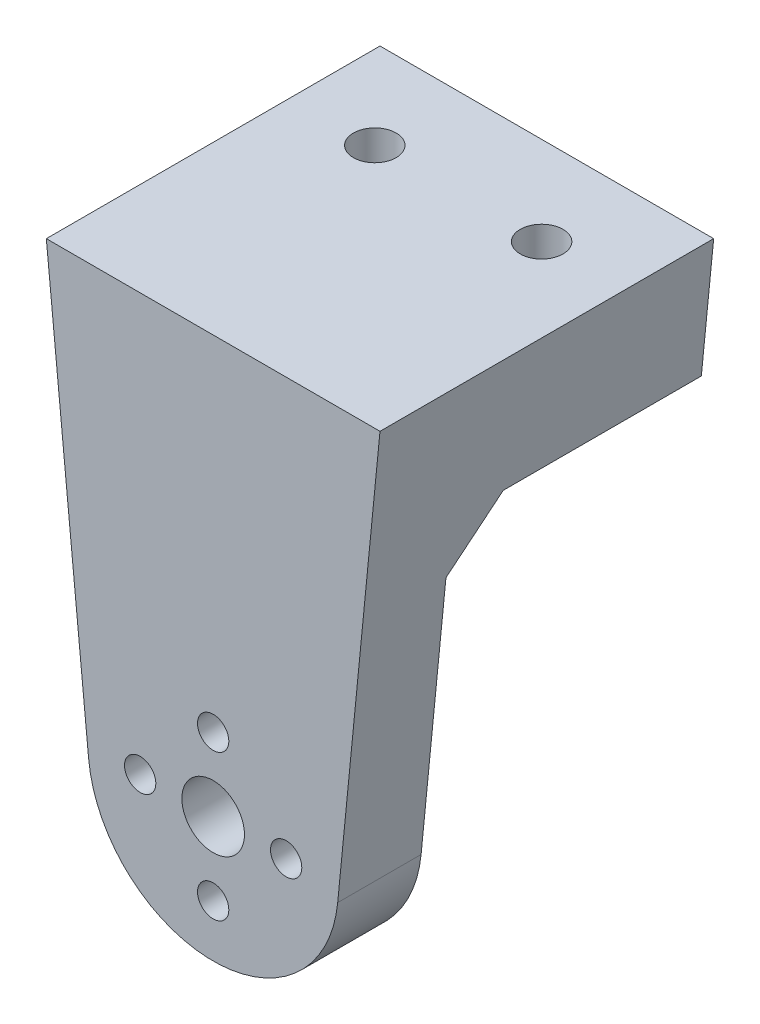
ISO-10303-21;
HEADER;
FILE_DESCRIPTION(('STEP AP214'),'2;1');
FILE_NAME('part.step','',(''),(''),'','','');
FILE_SCHEMA(('AUTOMOTIVE_DESIGN { 1 0 10303 214 1 1 1 1 }'));
ENDSEC;
DATA;
#1=APPLICATION_CONTEXT('core data for automotive mechanical design processes');
#2=APPLICATION_PROTOCOL_DEFINITION('international standard','automotive_design',2000,#1);
#3=PRODUCT_CONTEXT('',#1,'mechanical');
#4=PRODUCT('Part','Part','',(#3));
#5=PRODUCT_RELATED_PRODUCT_CATEGORY('part','',(#4));
#6=PRODUCT_DEFINITION_FORMATION('','',#4);
#7=PRODUCT_DEFINITION_CONTEXT('part definition',#1,'design');
#8=PRODUCT_DEFINITION('design','',#6,#7);
#9=PRODUCT_DEFINITION_SHAPE('','',#8);
#10=(LENGTH_UNIT() NAMED_UNIT(*) SI_UNIT(.MILLI.,.METRE.));
#11=(NAMED_UNIT(*) PLANE_ANGLE_UNIT() SI_UNIT($,.RADIAN.));
#12=(NAMED_UNIT(*) SI_UNIT($,.STERADIAN.) SOLID_ANGLE_UNIT());
#13=UNCERTAINTY_MEASURE_WITH_UNIT(LENGTH_MEASURE(1.E-05),#10,'distance_accuracy_value','');
#14=(GEOMETRIC_REPRESENTATION_CONTEXT(3) GLOBAL_UNCERTAINTY_ASSIGNED_CONTEXT((#13)) GLOBAL_UNIT_ASSIGNED_CONTEXT((#10,
#11,#12)) REPRESENTATION_CONTEXT('',''));
#15=CARTESIAN_POINT('',(0.,0.,0.));
#16=DIRECTION('',(0.,0.,1.));
#17=DIRECTION('',(1.,0.,0.));
#18=AXIS2_PLACEMENT_3D('',#15,#16,#17);
#19=CARTESIAN_POINT('',(0.,0.,0.));
#20=DIRECTION('',(0.,0.,1.));
#21=DIRECTION('',(1.,0.,0.));
#22=AXIS2_PLACEMENT_3D('',#19,#20,#21);
#23=PLANE('',#22);
#24=CARTESIAN_POINT('',(0.,0.,0.));
#25=DIRECTION('',(0.,0.,-1.));
#26=DIRECTION('',(-1.,0.,0.));
#27=AXIS2_PLACEMENT_3D('',#24,#25,#26);
#28=CIRCLE('',#27,3.);
#29=CARTESIAN_POINT('',(-3.,0.,0.));
#30=VERTEX_POINT('',#29);
#31=EDGE_CURVE('E115',#30,#30,#28,.T.);
#32=ORIENTED_EDGE('',*,*,#31,.F.);
#33=EDGE_LOOP('',(#32));
#34=FACE_BOUND('',#33,.T.);
#35=CARTESIAN_POINT('',(7.,0.,0.));
#36=DIRECTION('',(0.,0.,1.));
#37=DIRECTION('',(1.,0.,0.));
#38=AXIS2_PLACEMENT_3D('',#35,#36,#37);
#39=CIRCLE('',#38,1.5);
#40=CARTESIAN_POINT('',(8.5,0.,0.));
#41=VERTEX_POINT('',#40);
#42=EDGE_CURVE('E157',#41,#41,#39,.T.);
#43=ORIENTED_EDGE('',*,*,#42,.T.);
#44=EDGE_LOOP('',(#43));
#45=FACE_BOUND('',#44,.T.);
#46=CARTESIAN_POINT('',(0.,-7.,0.));
#47=DIRECTION('',(0.,0.,1.));
#48=DIRECTION('',(1.,0.,0.));
#49=AXIS2_PLACEMENT_3D('',#46,#47,#48);
#50=CIRCLE('',#49,1.5);
#51=CARTESIAN_POINT('',(1.5,-7.,0.));
#52=VERTEX_POINT('',#51);
#53=EDGE_CURVE('E154',#52,#52,#50,.T.);
#54=ORIENTED_EDGE('',*,*,#53,.T.);
#55=EDGE_LOOP('',(#54));
#56=FACE_BOUND('',#55,.T.);
#57=CARTESIAN_POINT('',(-7.,0.,0.));
#58=DIRECTION('',(0.,0.,1.));
#59=DIRECTION('',(1.,0.,0.));
#60=AXIS2_PLACEMENT_3D('',#57,#58,#59);
#61=CIRCLE('',#60,1.5);
#62=CARTESIAN_POINT('',(-5.5,0.,0.));
#63=VERTEX_POINT('',#62);
#64=EDGE_CURVE('E122',#63,#63,#61,.T.);
#65=ORIENTED_EDGE('',*,*,#64,.T.);
#66=EDGE_LOOP('',(#65));
#67=FACE_BOUND('',#66,.T.);
#68=CARTESIAN_POINT('',(0.,7.,0.));
#69=DIRECTION('',(0.,0.,1.));
#70=DIRECTION('',(1.,0.,0.));
#71=AXIS2_PLACEMENT_3D('',#68,#69,#70);
#72=CIRCLE('',#71,1.5);
#73=CARTESIAN_POINT('',(1.5,7.,0.));
#74=VERTEX_POINT('',#73);
#75=EDGE_CURVE('E119',#74,#74,#72,.T.);
#76=ORIENTED_EDGE('',*,*,#75,.T.);
#77=EDGE_LOOP('',(#76));
#78=FACE_BOUND('',#77,.T.);
#79=DIRECTION('',(-0.0980717390616762,0.99517934765419,0.));
#80=VECTOR('',#79,1.);
#81=CARTESIAN_POINT('',(-11.9421521718503,-1.17686086874011,0.));
#82=LINE('',#81,#80);
#83=CARTESIAN_POINT('',(-11.9421521718503,-1.17686086874012,0.));
#84=VERTEX_POINT('',#83);
#85=CARTESIAN_POINT('',(-14.324704418376,23.,0.));
#86=VERTEX_POINT('',#85);
#87=EDGE_CURVE('E131',#84,#86,#82,.T.);
#88=ORIENTED_EDGE('',*,*,#87,.T.);
#89=DIRECTION('',(1.,0.,0.));
#90=VECTOR('',#89,1.);
#91=CARTESIAN_POINT('',(14.8174384129713,23.,0.));
#92=LINE('',#91,#90);
#93=CARTESIAN_POINT('',(14.324704418376,23.,0.));
#94=VERTEX_POINT('',#93);
#95=EDGE_CURVE('E58',#86,#94,#92,.T.);
#96=ORIENTED_EDGE('',*,*,#95,.T.);
#97=DIRECTION('',(-0.0980717390616759,-0.99517934765419,0.));
#98=VECTOR('',#97,1.);
#99=CARTESIAN_POINT('',(11.9421521718503,-1.17686086874011,0.));
#100=LINE('',#99,#98);
#101=CARTESIAN_POINT('',(11.9421521718503,-1.17686086874011,0.));
#102=VERTEX_POINT('',#101);
#103=EDGE_CURVE('E163',#94,#102,#100,.T.);
#104=ORIENTED_EDGE('',*,*,#103,.T.);
#105=CARTESIAN_POINT('',(0.,0.,0.));
#106=DIRECTION('',(0.,0.,1.));
#107=DIRECTION('',(1.,0.,0.));
#108=AXIS2_PLACEMENT_3D('',#105,#106,#107);
#109=CIRCLE('',#108,12.);
#110=EDGE_CURVE('E160',#84,#102,#109,.T.);
#111=ORIENTED_EDGE('',*,*,#110,.F.);
#112=EDGE_LOOP('',(#88,#96,#104,#111));
#113=FACE_BOUND('',#112,.T.);
#114=ADVANCED_FACE('F36',(#34,#45,#56,#67,#78,#113),#23,.F.);
#115=CARTESIAN_POINT('',(0.,0.,8.));
#116=DIRECTION('',(0.,0.,-1.));
#117=DIRECTION('',(-1.,0.,0.));
#118=AXIS2_PLACEMENT_3D('',#115,#116,#117);
#119=CYLINDRICAL_SURFACE('',#118,12.);
#120=ORIENTED_EDGE('',*,*,#110,.T.);
#121=DIRECTION('',(0.,0.,-1.));
#122=VECTOR('',#121,1.);
#123=CARTESIAN_POINT('',(11.9421521718503,-1.17686086874011,8.));
#124=LINE('',#123,#122);
#125=CARTESIAN_POINT('',(11.9421521718503,-1.17686086874011,8.));
#126=VERTEX_POINT('',#125);
#127=EDGE_CURVE('E171',#126,#102,#124,.T.);
#128=ORIENTED_EDGE('',*,*,#127,.F.);
#129=CARTESIAN_POINT('',(0.,0.,8.));
#130=DIRECTION('',(0.,0.,1.));
#131=DIRECTION('',(1.,0.,0.));
#132=AXIS2_PLACEMENT_3D('',#129,#130,#131);
#133=CIRCLE('',#132,12.);
#134=CARTESIAN_POINT('',(-11.9421521718503,-1.17686086874012,8.));
#135=VERTEX_POINT('',#134);
#136=EDGE_CURVE('E140',#135,#126,#133,.T.);
#137=ORIENTED_EDGE('',*,*,#136,.F.);
#138=DIRECTION('',(0.,0.,-1.));
#139=VECTOR('',#138,1.);
#140=CARTESIAN_POINT('',(-11.9421521718503,-1.17686086874012,8.));
#141=LINE('',#140,#139);
#142=EDGE_CURVE('E150',#135,#84,#141,.T.);
#143=ORIENTED_EDGE('',*,*,#142,.T.);
#144=EDGE_LOOP('',(#120,#128,#137,#143));
#145=FACE_BOUND('',#144,.T.);
#146=ADVANCED_FACE('F210',(#145),#119,.T.);
#147=CARTESIAN_POINT('',(11.9421521718503,-1.17686086874011,8.));
#148=DIRECTION('',(0.99517934765419,-0.0980717390616759,0.));
#149=DIRECTION('',(0.0980717390616759,0.99517934765419,0.));
#150=AXIS2_PLACEMENT_3D('',#147,#148,#149);
#151=PLANE('',#150);
#152=ORIENTED_EDGE('',*,*,#103,.F.);
#153=DIRECTION('',(-0.0695145420373916,-0.705396246249341,0.705396246249348));
#154=VECTOR('',#153,1.);
#155=CARTESIAN_POINT('',(14.6742346406592,26.5468450128987,-3.54684501289869));
#156=LINE('',#155,#154);
#157=CARTESIAN_POINT('',(14.8174384129713,28.,-5.00000000000004));
#158=VERTEX_POINT('',#157);
#159=EDGE_CURVE('E11',#94,#158,#156,.F.);
#160=ORIENTED_EDGE('',*,*,#159,.T.);
#161=DIRECTION('',(0.,0.,1.));
#162=VECTOR('',#161,1.);
#163=CARTESIAN_POINT('',(14.8174384129713,28.,-24.));
#164=LINE('',#163,#162);
#165=CARTESIAN_POINT('',(14.8174384129713,28.,-24.));
#166=VERTEX_POINT('',#165);
#167=EDGE_CURVE('E100',#166,#158,#164,.T.);
#168=ORIENTED_EDGE('',*,*,#167,.F.);
#169=DIRECTION('',(-0.0980717390616759,-0.99517934765419,0.));
#170=VECTOR('',#169,1.);
#171=CARTESIAN_POINT('',(16.,40.,-24.));
#172=LINE('',#171,#170);
#173=CARTESIAN_POINT('',(16.,40.,-24.));
#174=VERTEX_POINT('',#173);
#175=EDGE_CURVE('E107',#174,#166,#172,.T.);
#176=ORIENTED_EDGE('',*,*,#175,.F.);
#177=DIRECTION('',(0.,0.,-1.));
#178=VECTOR('',#177,1.);
#179=CARTESIAN_POINT('',(16.,40.,8.));
#180=LINE('',#179,#178);
#181=CARTESIAN_POINT('',(16.,40.,8.));
#182=VERTEX_POINT('',#181);
#183=EDGE_CURVE('E169',#182,#174,#180,.T.);
#184=ORIENTED_EDGE('',*,*,#183,.F.);
#185=DIRECTION('',(-0.0980717390616759,-0.99517934765419,0.));
#186=VECTOR('',#185,1.);
#187=CARTESIAN_POINT('',(11.9421521718503,-1.17686086874011,8.));
#188=LINE('',#187,#186);
#189=EDGE_CURVE('E142',#182,#126,#188,.T.);
#190=ORIENTED_EDGE('',*,*,#189,.T.);
#191=ORIENTED_EDGE('',*,*,#127,.T.);
#192=EDGE_LOOP('',(#152,#160,#168,#176,#184,#190,#191));
#193=FACE_BOUND('',#192,.T.);
#194=ADVANCED_FACE('F117',(#193),#151,.T.);
#195=CARTESIAN_POINT('',(0.,40.,8.));
#196=DIRECTION('',(0.,1.,0.));
#197=DIRECTION('',(-1.,0.,0.));
#198=AXIS2_PLACEMENT_3D('',#195,#196,#197);
#199=PLANE('',#198);
#200=CARTESIAN_POINT('',(-8.00000000000001,40.,-15.5));
#201=DIRECTION('',(0.,1.,0.));
#202=DIRECTION('',(-1.,0.,0.));
#203=AXIS2_PLACEMENT_3D('',#200,#201,#202);
#204=CIRCLE('',#203,2.05);
#205=CARTESIAN_POINT('',(-10.05,40.,-15.5));
#206=VERTEX_POINT('',#205);
#207=EDGE_CURVE('E192',#206,#206,#204,.F.);
#208=ORIENTED_EDGE('',*,*,#207,.T.);
#209=EDGE_LOOP('',(#208));
#210=FACE_BOUND('',#209,.T.);
#211=CARTESIAN_POINT('',(7.99999999999999,40.,-15.5));
#212=DIRECTION('',(0.,-1.,0.));
#213=DIRECTION('',(1.,0.,0.));
#214=AXIS2_PLACEMENT_3D('',#211,#212,#213);
#215=CIRCLE('',#214,2.05);
#216=CARTESIAN_POINT('',(10.05,40.,-15.5));
#217=VERTEX_POINT('',#216);
#218=EDGE_CURVE('E189',#217,#217,#215,.T.);
#219=ORIENTED_EDGE('',*,*,#218,.T.);
#220=EDGE_LOOP('',(#219));
#221=FACE_BOUND('',#220,.T.);
#222=ORIENTED_EDGE('',*,*,#183,.T.);
#223=DIRECTION('',(1.,0.,0.));
#224=VECTOR('',#223,1.);
#225=CARTESIAN_POINT('',(-16.,40.,-24.));
#226=LINE('',#225,#224);
#227=CARTESIAN_POINT('',(-16.,40.,-24.));
#228=VERTEX_POINT('',#227);
#229=EDGE_CURVE('E113',#228,#174,#226,.T.);
#230=ORIENTED_EDGE('',*,*,#229,.F.);
#231=DIRECTION('',(0.,0.,-1.));
#232=VECTOR('',#231,1.);
#233=CARTESIAN_POINT('',(-16.,40.,8.));
#234=LINE('',#233,#232);
#235=CARTESIAN_POINT('',(-16.,40.,8.));
#236=VERTEX_POINT('',#235);
#237=EDGE_CURVE('E167',#236,#228,#234,.T.);
#238=ORIENTED_EDGE('',*,*,#237,.F.);
#239=DIRECTION('',(1.,0.,0.));
#240=VECTOR('',#239,1.);
#241=CARTESIAN_POINT('',(0.,40.,8.));
#242=LINE('',#241,#240);
#243=EDGE_CURVE('E145',#236,#182,#242,.T.);
#244=ORIENTED_EDGE('',*,*,#243,.T.);
#245=EDGE_LOOP('',(#222,#230,#238,#244));
#246=FACE_BOUND('',#245,.T.);
#247=ADVANCED_FACE('F227',(#210,#221,#246),#199,.T.);
#248=CARTESIAN_POINT('',(7.,0.,8.));
#249=DIRECTION('',(0.,0.,-1.));
#250=DIRECTION('',(-1.,0.,0.));
#251=AXIS2_PLACEMENT_3D('',#248,#249,#250);
#252=CYLINDRICAL_SURFACE('',#251,1.5);
#253=CARTESIAN_POINT('',(7.,0.,8.));
#254=DIRECTION('',(0.,0.,1.));
#255=DIRECTION('',(1.,0.,0.));
#256=AXIS2_PLACEMENT_3D('',#253,#254,#255);
#257=CIRCLE('',#256,1.5);
#258=CARTESIAN_POINT('',(8.5,0.,8.));
#259=VERTEX_POINT('',#258);
#260=EDGE_CURVE('E137',#259,#259,#257,.T.);
#261=ORIENTED_EDGE('',*,*,#260,.T.);
#262=EDGE_LOOP('',(#261));
#263=FACE_BOUND('',#262,.T.);
#264=ORIENTED_EDGE('',*,*,#42,.F.);
#265=EDGE_LOOP('',(#264));
#266=FACE_BOUND('',#265,.T.);
#267=ADVANCED_FACE('F230',(#263,#266),#252,.F.);
#268=CARTESIAN_POINT('',(0.,-7.,8.));
#269=DIRECTION('',(0.,0.,-1.));
#270=DIRECTION('',(-1.,0.,0.));
#271=AXIS2_PLACEMENT_3D('',#268,#269,#270);
#272=CYLINDRICAL_SURFACE('',#271,1.5);
#273=CARTESIAN_POINT('',(0.,-7.,8.));
#274=DIRECTION('',(0.,0.,1.));
#275=DIRECTION('',(1.,0.,0.));
#276=AXIS2_PLACEMENT_3D('',#273,#274,#275);
#277=CIRCLE('',#276,1.5);
#278=CARTESIAN_POINT('',(1.5,-7.,8.));
#279=VERTEX_POINT('',#278);
#280=EDGE_CURVE('E134',#279,#279,#277,.T.);
#281=ORIENTED_EDGE('',*,*,#280,.T.);
#282=EDGE_LOOP('',(#281));
#283=FACE_BOUND('',#282,.T.);
#284=ORIENTED_EDGE('',*,*,#53,.F.);
#285=EDGE_LOOP('',(#284));
#286=FACE_BOUND('',#285,.T.);
#287=ADVANCED_FACE('F236',(#283,#286),#272,.F.);
#288=CARTESIAN_POINT('',(-7.,0.,8.));
#289=DIRECTION('',(0.,0.,-1.));
#290=DIRECTION('',(-1.,0.,0.));
#291=AXIS2_PLACEMENT_3D('',#288,#289,#290);
#292=CYLINDRICAL_SURFACE('',#291,1.5);
#293=CARTESIAN_POINT('',(-7.,0.,8.));
#294=DIRECTION('',(0.,0.,1.));
#295=DIRECTION('',(1.,0.,0.));
#296=AXIS2_PLACEMENT_3D('',#293,#294,#295);
#297=CIRCLE('',#296,1.5);
#298=CARTESIAN_POINT('',(-5.5,0.,8.));
#299=VERTEX_POINT('',#298);
#300=EDGE_CURVE('E130',#299,#299,#297,.T.);
#301=ORIENTED_EDGE('',*,*,#300,.T.);
#302=EDGE_LOOP('',(#301));
#303=FACE_BOUND('',#302,.T.);
#304=ORIENTED_EDGE('',*,*,#64,.F.);
#305=EDGE_LOOP('',(#304));
#306=FACE_BOUND('',#305,.T.);
#307=ADVANCED_FACE('F240',(#303,#306),#292,.F.);
#308=CARTESIAN_POINT('',(0.,7.,8.));
#309=DIRECTION('',(0.,0.,-1.));
#310=DIRECTION('',(-1.,0.,0.));
#311=AXIS2_PLACEMENT_3D('',#308,#309,#310);
#312=CYLINDRICAL_SURFACE('',#311,1.5);
#313=CARTESIAN_POINT('',(0.,7.,8.));
#314=DIRECTION('',(0.,0.,1.));
#315=DIRECTION('',(1.,0.,0.));
#316=AXIS2_PLACEMENT_3D('',#313,#314,#315);
#317=CIRCLE('',#316,1.5);
#318=CARTESIAN_POINT('',(1.5,7.,8.));
#319=VERTEX_POINT('',#318);
#320=EDGE_CURVE('E127',#319,#319,#317,.T.);
#321=ORIENTED_EDGE('',*,*,#320,.T.);
#322=EDGE_LOOP('',(#321));
#323=FACE_BOUND('',#322,.T.);
#324=ORIENTED_EDGE('',*,*,#75,.F.);
#325=EDGE_LOOP('',(#324));
#326=FACE_BOUND('',#325,.T.);
#327=ADVANCED_FACE('F226',(#323,#326),#312,.F.);
#328=CARTESIAN_POINT('',(-11.9421521718503,-1.17686086874011,8.));
#329=DIRECTION('',(-0.99517934765419,-0.0980717390616762,0.));
#330=DIRECTION('',(0.0980717390616762,-0.99517934765419,0.));
#331=AXIS2_PLACEMENT_3D('',#328,#329,#330);
#332=PLANE('',#331);
#333=ORIENTED_EDGE('',*,*,#87,.F.);
#334=ORIENTED_EDGE('',*,*,#142,.F.);
#335=DIRECTION('',(-0.0980717390616762,0.99517934765419,0.));
#336=VECTOR('',#335,1.);
#337=CARTESIAN_POINT('',(-11.9421521718503,-1.17686086874011,8.));
#338=LINE('',#337,#336);
#339=EDGE_CURVE('E148',#135,#236,#338,.T.);
#340=ORIENTED_EDGE('',*,*,#339,.T.);
#341=ORIENTED_EDGE('',*,*,#237,.T.);
#342=DIRECTION('',(-0.0980717390616758,0.99517934765419,0.));
#343=VECTOR('',#342,1.);
#344=CARTESIAN_POINT('',(-14.8174384129713,28.,-24.));
#345=LINE('',#344,#343);
#346=CARTESIAN_POINT('',(-14.8174384129713,28.,-24.));
#347=VERTEX_POINT('',#346);
#348=EDGE_CURVE('E106',#347,#228,#345,.T.);
#349=ORIENTED_EDGE('',*,*,#348,.F.);
#350=DIRECTION('',(0.,0.,1.));
#351=VECTOR('',#350,1.);
#352=CARTESIAN_POINT('',(-14.8174384129713,28.,-24.));
#353=LINE('',#352,#351);
#354=CARTESIAN_POINT('',(-14.8174384129713,28.,-5.00000000000004));
#355=VERTEX_POINT('',#354);
#356=EDGE_CURVE('E102',#347,#355,#353,.T.);
#357=ORIENTED_EDGE('',*,*,#356,.T.);
#358=DIRECTION('',(-0.0695145420373917,0.705396246249341,-0.705396246249348));
#359=VECTOR('',#358,1.);
#360=CARTESIAN_POINT('',(-14.8174384129713,28.,-5.00000000000004));
#361=LINE('',#360,#359);
#362=EDGE_CURVE('E45',#355,#86,#361,.F.);
#363=ORIENTED_EDGE('',*,*,#362,.T.);
#364=EDGE_LOOP('',(#333,#334,#340,#341,#349,#357,#363));
#365=FACE_BOUND('',#364,.T.);
#366=ADVANCED_FACE('F177',(#365),#332,.T.);
#367=CARTESIAN_POINT('',(0.,0.,8.));
#368=DIRECTION('',(0.,0.,1.));
#369=DIRECTION('',(1.,0.,0.));
#370=AXIS2_PLACEMENT_3D('',#367,#368,#369);
#371=PLANE('',#370);
#372=CARTESIAN_POINT('',(0.,0.,8.));
#373=DIRECTION('',(0.,0.,1.));
#374=DIRECTION('',(1.,0.,0.));
#375=AXIS2_PLACEMENT_3D('',#372,#373,#374);
#376=CIRCLE('',#375,3.);
#377=CARTESIAN_POINT('',(3.,0.,8.));
#378=VERTEX_POINT('',#377);
#379=EDGE_CURVE('E180',#378,#378,#376,.F.);
#380=ORIENTED_EDGE('',*,*,#379,.T.);
#381=EDGE_LOOP('',(#380));
#382=FACE_BOUND('',#381,.T.);
#383=ORIENTED_EDGE('',*,*,#320,.F.);
#384=EDGE_LOOP('',(#383));
#385=FACE_BOUND('',#384,.T.);
#386=ORIENTED_EDGE('',*,*,#300,.F.);
#387=EDGE_LOOP('',(#386));
#388=FACE_BOUND('',#387,.T.);
#389=ORIENTED_EDGE('',*,*,#280,.F.);
#390=EDGE_LOOP('',(#389));
#391=FACE_BOUND('',#390,.T.);
#392=ORIENTED_EDGE('',*,*,#260,.F.);
#393=EDGE_LOOP('',(#392));
#394=FACE_BOUND('',#393,.T.);
#395=ORIENTED_EDGE('',*,*,#136,.T.);
#396=ORIENTED_EDGE('',*,*,#189,.F.);
#397=ORIENTED_EDGE('',*,*,#243,.F.);
#398=ORIENTED_EDGE('',*,*,#339,.F.);
#399=EDGE_LOOP('',(#395,#396,#397,#398));
#400=FACE_BOUND('',#399,.T.);
#401=ADVANCED_FACE('F222',(#382,#385,#388,#391,#394,#400),#371,.T.);
#402=CARTESIAN_POINT('',(-14.8174384129713,28.,-24.));
#403=DIRECTION('',(0.,1.,0.));
#404=DIRECTION('',(-1.,0.,0.));
#405=AXIS2_PLACEMENT_3D('',#402,#403,#404);
#406=PLANE('',#405);
#407=ORIENTED_EDGE('',*,*,#167,.T.);
#408=DIRECTION('',(-1.,0.,0.));
#409=VECTOR('',#408,1.);
#410=CARTESIAN_POINT('',(-14.8174384129713,28.,-5.00000000000004));
#411=LINE('',#410,#409);
#412=EDGE_CURVE('E174',#158,#355,#411,.T.);
#413=ORIENTED_EDGE('',*,*,#412,.T.);
#414=ORIENTED_EDGE('',*,*,#356,.F.);
#415=DIRECTION('',(-1.,0.,0.));
#416=VECTOR('',#415,1.);
#417=CARTESIAN_POINT('',(-14.8174384129713,28.,-24.));
#418=LINE('',#417,#416);
#419=EDGE_CURVE('E95',#166,#347,#418,.T.);
#420=ORIENTED_EDGE('',*,*,#419,.F.);
#421=EDGE_LOOP('',(#407,#413,#414,#420));
#422=FACE_BOUND('',#421,.T.);
#423=ADVANCED_FACE('F97',(#422),#406,.F.);
#424=CARTESIAN_POINT('',(0.,0.,-24.));
#425=DIRECTION('',(0.,0.,1.));
#426=DIRECTION('',(1.,0.,0.));
#427=AXIS2_PLACEMENT_3D('',#424,#425,#426);
#428=PLANE('',#427);
#429=ORIENTED_EDGE('',*,*,#175,.T.);
#430=ORIENTED_EDGE('',*,*,#419,.T.);
#431=ORIENTED_EDGE('',*,*,#348,.T.);
#432=ORIENTED_EDGE('',*,*,#229,.T.);
#433=EDGE_LOOP('',(#429,#430,#431,#432));
#434=FACE_BOUND('',#433,.T.);
#435=ADVANCED_FACE('F111',(#434),#428,.F.);
#436=CARTESIAN_POINT('',(-14.8174384129713,28.,-5.00000000000004));
#437=DIRECTION('',(0.,-0.707106781186551,-0.707106781186544));
#438=DIRECTION('',(1.,0.,0.));
#439=AXIS2_PLACEMENT_3D('',#436,#437,#438);
#440=PLANE('',#439);
#441=ORIENTED_EDGE('',*,*,#159,.F.);
#442=ORIENTED_EDGE('',*,*,#95,.F.);
#443=ORIENTED_EDGE('',*,*,#362,.F.);
#444=ORIENTED_EDGE('',*,*,#412,.F.);
#445=EDGE_LOOP('',(#441,#442,#443,#444));
#446=FACE_BOUND('',#445,.T.);
#447=ADVANCED_FACE('F39',(#446),#440,.T.);
#448=CARTESIAN_POINT('',(0.,0.,8.001));
#449=DIRECTION('',(0.,0.,-1.));
#450=DIRECTION('',(-1.,0.,0.));
#451=AXIS2_PLACEMENT_3D('',#448,#449,#450);
#452=CYLINDRICAL_SURFACE('',#451,3.);
#453=ORIENTED_EDGE('',*,*,#379,.F.);
#454=EDGE_LOOP('',(#453));
#455=FACE_BOUND('',#454,.T.);
#456=ORIENTED_EDGE('',*,*,#31,.T.);
#457=EDGE_LOOP('',(#456));
#458=FACE_BOUND('',#457,.T.);
#459=ADVANCED_FACE('F254',(#455,#458),#452,.F.);
#460=CARTESIAN_POINT('',(7.99999999999999,35.,-15.5));
#461=DIRECTION('',(0.,1.,0.));
#462=DIRECTION('',(-1.,0.,0.));
#463=AXIS2_PLACEMENT_3D('',#460,#461,#462);
#464=CYLINDRICAL_SURFACE('',#463,2.05);
#465=CARTESIAN_POINT('',(7.99999999999999,35.,-15.5));
#466=DIRECTION('',(0.,-1.,0.));
#467=DIRECTION('',(1.,0.,0.));
#468=AXIS2_PLACEMENT_3D('',#465,#466,#467);
#469=CIRCLE('',#468,2.05);
#470=CARTESIAN_POINT('',(10.05,35.,-15.5));
#471=VERTEX_POINT('',#470);
#472=EDGE_CURVE('E186',#471,#471,#469,.T.);
#473=ORIENTED_EDGE('',*,*,#472,.T.);
#474=EDGE_LOOP('',(#473));
#475=FACE_BOUND('',#474,.T.);
#476=ORIENTED_EDGE('',*,*,#218,.F.);
#477=EDGE_LOOP('',(#476));
#478=FACE_BOUND('',#477,.T.);
#479=ADVANCED_FACE('F259',(#475,#478),#464,.F.);
#480=CARTESIAN_POINT('',(7.99999999999999,35.,-15.5));
#481=DIRECTION('',(0.,-1.,0.));
#482=DIRECTION('',(1.,0.,0.));
#483=AXIS2_PLACEMENT_3D('',#480,#481,#482);
#484=PLANE('',#483);
#485=ORIENTED_EDGE('',*,*,#472,.F.);
#486=EDGE_LOOP('',(#485));
#487=FACE_BOUND('',#486,.T.);
#488=ADVANCED_FACE('F207',(#487),#484,.F.);
#489=CARTESIAN_POINT('',(-8.00000000000001,35.,-15.5));
#490=DIRECTION('',(0.,1.,0.));
#491=DIRECTION('',(-1.,0.,0.));
#492=AXIS2_PLACEMENT_3D('',#489,#490,#491);
#493=CYLINDRICAL_SURFACE('',#492,2.05);
#494=CARTESIAN_POINT('',(-8.00000000000001,35.,-15.5));
#495=DIRECTION('',(0.,1.,0.));
#496=DIRECTION('',(-1.,0.,0.));
#497=AXIS2_PLACEMENT_3D('',#494,#495,#496);
#498=CIRCLE('',#497,2.05);
#499=CARTESIAN_POINT('',(-10.05,35.,-15.5));
#500=VERTEX_POINT('',#499);
#501=EDGE_CURVE('E183',#500,#500,#498,.F.);
#502=ORIENTED_EDGE('',*,*,#501,.T.);
#503=EDGE_LOOP('',(#502));
#504=FACE_BOUND('',#503,.T.);
#505=ORIENTED_EDGE('',*,*,#207,.F.);
#506=EDGE_LOOP('',(#505));
#507=FACE_BOUND('',#506,.T.);
#508=ADVANCED_FACE('F198',(#504,#507),#493,.F.);
#509=CARTESIAN_POINT('',(0.,35.,0.));
#510=DIRECTION('',(0.,1.,0.));
#511=DIRECTION('',(-1.,0.,0.));
#512=AXIS2_PLACEMENT_3D('',#509,#510,#511);
#513=PLANE('',#512);
#514=ORIENTED_EDGE('',*,*,#501,.F.);
#515=EDGE_LOOP('',(#514));
#516=FACE_BOUND('',#515,.T.);
#517=ADVANCED_FACE('F201',(#516),#513,.T.);
#518=CLOSED_SHELL('',(#114,#146,#194,#247,#267,#287,#307,#327,#366,#401,#423,#435,#447,#459,
#479,#488,#508,#517));
#519=MANIFOLD_SOLID_BREP('B2',#518);
#520=ADVANCED_BREP_SHAPE_REPRESENTATION('',(#18,#519),#14);
#521=SHAPE_DEFINITION_REPRESENTATION(#9,#520);
ENDSEC;
END-ISO-10303-21;
